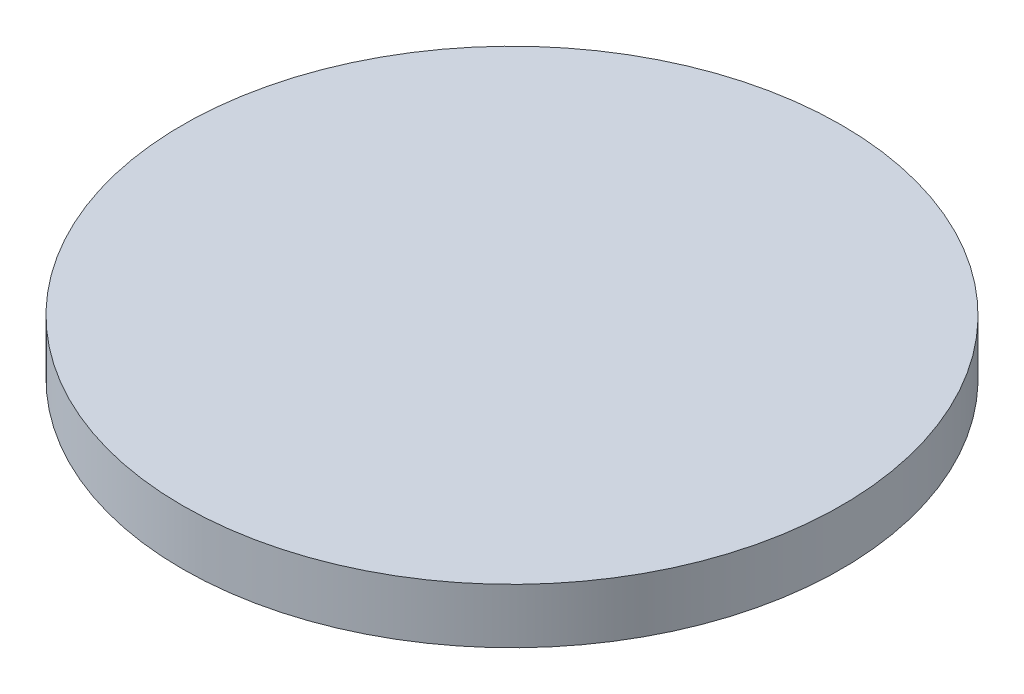
ISO-10303-21;
HEADER;
FILE_DESCRIPTION(('STEP AP214'),'2;1');
FILE_NAME('part.step','',(''),(''),'','','');
FILE_SCHEMA(('AUTOMOTIVE_DESIGN { 1 0 10303 214 1 1 1 1 }'));
ENDSEC;
DATA;
#1=APPLICATION_CONTEXT('core data for automotive mechanical design processes');
#2=APPLICATION_PROTOCOL_DEFINITION('international standard','automotive_design',2000,#1);
#3=PRODUCT_CONTEXT('',#1,'mechanical');
#4=PRODUCT('Part','Part','',(#3));
#5=PRODUCT_RELATED_PRODUCT_CATEGORY('part','',(#4));
#6=PRODUCT_DEFINITION_FORMATION('','',#4);
#7=PRODUCT_DEFINITION_CONTEXT('part definition',#1,'design');
#8=PRODUCT_DEFINITION('design','',#6,#7);
#9=PRODUCT_DEFINITION_SHAPE('','',#8);
#10=(LENGTH_UNIT() NAMED_UNIT(*) SI_UNIT(.MILLI.,.METRE.));
#11=(NAMED_UNIT(*) PLANE_ANGLE_UNIT() SI_UNIT($,.RADIAN.));
#12=(NAMED_UNIT(*) SI_UNIT($,.STERADIAN.) SOLID_ANGLE_UNIT());
#13=UNCERTAINTY_MEASURE_WITH_UNIT(LENGTH_MEASURE(1.E-05),#10,'distance_accuracy_value','');
#14=(GEOMETRIC_REPRESENTATION_CONTEXT(3) GLOBAL_UNCERTAINTY_ASSIGNED_CONTEXT((#13)) GLOBAL_UNIT_ASSIGNED_CONTEXT((#10,
#11,#12)) REPRESENTATION_CONTEXT('',''));
#15=CARTESIAN_POINT('',(0.,0.,0.));
#16=DIRECTION('',(0.,0.,1.));
#17=DIRECTION('',(1.,0.,0.));
#18=AXIS2_PLACEMENT_3D('',#15,#16,#17);
#19=CARTESIAN_POINT('',(0.,6.35,0.));
#20=DIRECTION('',(0.,-1.,0.));
#21=DIRECTION('',(0.,0.,-1.));
#22=AXIS2_PLACEMENT_3D('',#19,#20,#21);
#23=CYLINDRICAL_SURFACE('',#22,38.1);
#24=CARTESIAN_POINT('',(0.,6.35,0.));
#25=DIRECTION('',(0.,1.,0.));
#26=DIRECTION('',(0.,0.,1.));
#27=AXIS2_PLACEMENT_3D('',#24,#25,#26);
#28=CIRCLE('',#27,38.1);
#29=CARTESIAN_POINT('',(0.,6.35,38.1));
#30=VERTEX_POINT('',#29);
#31=EDGE_CURVE('E10',#30,#30,#28,.T.);
#32=ORIENTED_EDGE('',*,*,#31,.F.);
#33=EDGE_LOOP('',(#32));
#34=FACE_BOUND('',#33,.T.);
#35=CARTESIAN_POINT('',(0.,0.,0.));
#36=DIRECTION('',(0.,1.,0.));
#37=DIRECTION('',(0.,0.,1.));
#38=AXIS2_PLACEMENT_3D('',#35,#36,#37);
#39=CIRCLE('',#38,38.1);
#40=CARTESIAN_POINT('',(0.,0.,38.1));
#41=VERTEX_POINT('',#40);
#42=EDGE_CURVE('E33',#41,#41,#39,.T.);
#43=ORIENTED_EDGE('',*,*,#42,.T.);
#44=EDGE_LOOP('',(#43));
#45=FACE_BOUND('',#44,.T.);
#46=ADVANCED_FACE('F30',(#34,#45),#23,.T.);
#47=CARTESIAN_POINT('',(0.,6.35,0.));
#48=DIRECTION('',(0.,1.,0.));
#49=DIRECTION('',(0.,0.,1.));
#50=AXIS2_PLACEMENT_3D('',#47,#48,#49);
#51=PLANE('',#50);
#52=ORIENTED_EDGE('',*,*,#31,.T.);
#53=EDGE_LOOP('',(#52));
#54=FACE_BOUND('',#53,.T.);
#55=ADVANCED_FACE('F45',(#54),#51,.T.);
#56=CARTESIAN_POINT('',(0.,0.,0.));
#57=DIRECTION('',(0.,1.,0.));
#58=DIRECTION('',(0.,0.,1.));
#59=AXIS2_PLACEMENT_3D('',#56,#57,#58);
#60=PLANE('',#59);
#61=ORIENTED_EDGE('',*,*,#42,.F.);
#62=EDGE_LOOP('',(#61));
#63=FACE_BOUND('',#62,.T.);
#64=ADVANCED_FACE('F43',(#63),#60,.F.);
#65=CLOSED_SHELL('',(#46,#55,#64));
#66=MANIFOLD_SOLID_BREP('B2',#65);
#67=ADVANCED_BREP_SHAPE_REPRESENTATION('',(#18,#66),#14);
#68=SHAPE_DEFINITION_REPRESENTATION(#9,#67);
ENDSEC;
END-ISO-10303-21;
